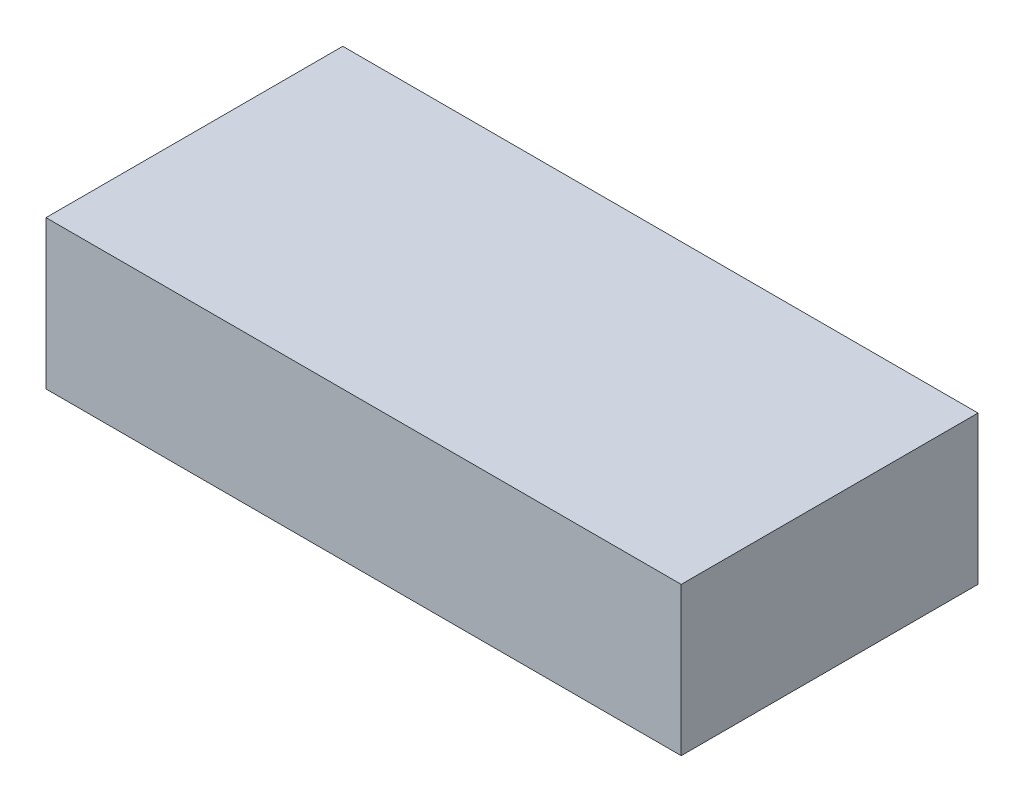
ISO-10303-21;
HEADER;
FILE_DESCRIPTION(('STEP AP214'),'2;1');
FILE_NAME('part.step','',(''),(''),'','','');
FILE_SCHEMA(('AUTOMOTIVE_DESIGN { 1 0 10303 214 1 1 1 1 }'));
ENDSEC;
DATA;
#1=APPLICATION_CONTEXT('core data for automotive mechanical design processes');
#2=APPLICATION_PROTOCOL_DEFINITION('international standard','automotive_design',2000,#1);
#3=PRODUCT_CONTEXT('',#1,'mechanical');
#4=PRODUCT('Part','Part','',(#3));
#5=PRODUCT_RELATED_PRODUCT_CATEGORY('part','',(#4));
#6=PRODUCT_DEFINITION_FORMATION('','',#4);
#7=PRODUCT_DEFINITION_CONTEXT('part definition',#1,'design');
#8=PRODUCT_DEFINITION('design','',#6,#7);
#9=PRODUCT_DEFINITION_SHAPE('','',#8);
#10=(LENGTH_UNIT() NAMED_UNIT(*) SI_UNIT(.MILLI.,.METRE.));
#11=(NAMED_UNIT(*) PLANE_ANGLE_UNIT() SI_UNIT($,.RADIAN.));
#12=(NAMED_UNIT(*) SI_UNIT($,.STERADIAN.) SOLID_ANGLE_UNIT());
#13=UNCERTAINTY_MEASURE_WITH_UNIT(LENGTH_MEASURE(1.E-05),#10,'distance_accuracy_value','');
#14=(GEOMETRIC_REPRESENTATION_CONTEXT(3) GLOBAL_UNCERTAINTY_ASSIGNED_CONTEXT((#13)) GLOBAL_UNIT_ASSIGNED_CONTEXT((#10,
#11,#12)) REPRESENTATION_CONTEXT('',''));
#15=CARTESIAN_POINT('',(0.,0.,0.));
#16=DIRECTION('',(0.,0.,1.));
#17=DIRECTION('',(1.,0.,0.));
#18=AXIS2_PLACEMENT_3D('',#15,#16,#17);
#19=CARTESIAN_POINT('',(244.,114.,-114.));
#20=DIRECTION('',(-1.,0.,0.));
#21=DIRECTION('',(0.,0.,1.));
#22=AXIS2_PLACEMENT_3D('',#19,#20,#21);
#23=PLANE('',#22);
#24=DIRECTION('',(0.,0.,-1.));
#25=VECTOR('',#24,1.);
#26=CARTESIAN_POINT('',(244.,0.,-114.));
#27=LINE('',#26,#25);
#28=CARTESIAN_POINT('',(244.,0.,114.));
#29=VERTEX_POINT('',#28);
#30=CARTESIAN_POINT('',(244.,0.,-114.));
#31=VERTEX_POINT('',#30);
#32=EDGE_CURVE('E107',#29,#31,#27,.T.);
#33=ORIENTED_EDGE('',*,*,#32,.T.);
#34=DIRECTION('',(0.,-1.,0.));
#35=VECTOR('',#34,1.);
#36=CARTESIAN_POINT('',(244.,114.,-114.));
#37=LINE('',#36,#35);
#38=CARTESIAN_POINT('',(244.,114.,-114.));
#39=VERTEX_POINT('',#38);
#40=EDGE_CURVE('E11',#39,#31,#37,.T.);
#41=ORIENTED_EDGE('',*,*,#40,.F.);
#42=DIRECTION('',(0.,0.,-1.));
#43=VECTOR('',#42,1.);
#44=CARTESIAN_POINT('',(244.,114.,-114.));
#45=LINE('',#44,#43);
#46=CARTESIAN_POINT('',(244.,114.,114.));
#47=VERTEX_POINT('',#46);
#48=EDGE_CURVE('E91',#47,#39,#45,.T.);
#49=ORIENTED_EDGE('',*,*,#48,.F.);
#50=DIRECTION('',(0.,-1.,0.));
#51=VECTOR('',#50,1.);
#52=CARTESIAN_POINT('',(244.,114.,114.));
#53=LINE('',#52,#51);
#54=EDGE_CURVE('E103',#47,#29,#53,.T.);
#55=ORIENTED_EDGE('',*,*,#54,.T.);
#56=EDGE_LOOP('',(#33,#41,#49,#55));
#57=FACE_BOUND('',#56,.T.);
#58=ADVANCED_FACE('F39',(#57),#23,.F.);
#59=CARTESIAN_POINT('',(-244.,114.,-114.));
#60=DIRECTION('',(0.,0.,1.));
#61=DIRECTION('',(1.,0.,0.));
#62=AXIS2_PLACEMENT_3D('',#59,#60,#61);
#63=PLANE('',#62);
#64=DIRECTION('',(-1.,0.,0.));
#65=VECTOR('',#64,1.);
#66=CARTESIAN_POINT('',(-244.,0.,-114.));
#67=LINE('',#66,#65);
#68=CARTESIAN_POINT('',(-244.,0.,-114.));
#69=VERTEX_POINT('',#68);
#70=EDGE_CURVE('E96',#31,#69,#67,.T.);
#71=ORIENTED_EDGE('',*,*,#70,.T.);
#72=DIRECTION('',(0.,-1.,0.));
#73=VECTOR('',#72,1.);
#74=CARTESIAN_POINT('',(-244.,114.,-114.));
#75=LINE('',#74,#73);
#76=CARTESIAN_POINT('',(-244.,114.,-114.));
#77=VERTEX_POINT('',#76);
#78=EDGE_CURVE('E48',#77,#69,#75,.T.);
#79=ORIENTED_EDGE('',*,*,#78,.F.);
#80=DIRECTION('',(-1.,0.,0.));
#81=VECTOR('',#80,1.);
#82=CARTESIAN_POINT('',(-244.,114.,-114.));
#83=LINE('',#82,#81);
#84=EDGE_CURVE('E86',#39,#77,#83,.T.);
#85=ORIENTED_EDGE('',*,*,#84,.F.);
#86=ORIENTED_EDGE('',*,*,#40,.T.);
#87=EDGE_LOOP('',(#71,#79,#85,#86));
#88=FACE_BOUND('',#87,.T.);
#89=ADVANCED_FACE('F95',(#88),#63,.F.);
#90=CARTESIAN_POINT('',(-244.,114.,-114.));
#91=DIRECTION('',(1.,0.,0.));
#92=DIRECTION('',(0.,0.,-1.));
#93=AXIS2_PLACEMENT_3D('',#90,#91,#92);
#94=PLANE('',#93);
#95=DIRECTION('',(0.,0.,1.));
#96=VECTOR('',#95,1.);
#97=CARTESIAN_POINT('',(-244.,0.,-114.));
#98=LINE('',#97,#96);
#99=CARTESIAN_POINT('',(-244.,0.,114.));
#100=VERTEX_POINT('',#99);
#101=EDGE_CURVE('E73',#69,#100,#98,.T.);
#102=ORIENTED_EDGE('',*,*,#101,.T.);
#103=DIRECTION('',(0.,-1.,0.));
#104=VECTOR('',#103,1.);
#105=CARTESIAN_POINT('',(-244.,114.,114.));
#106=LINE('',#105,#104);
#107=CARTESIAN_POINT('',(-244.,114.,114.));
#108=VERTEX_POINT('',#107);
#109=EDGE_CURVE('E98',#108,#100,#106,.T.);
#110=ORIENTED_EDGE('',*,*,#109,.F.);
#111=DIRECTION('',(0.,0.,1.));
#112=VECTOR('',#111,1.);
#113=CARTESIAN_POINT('',(-244.,114.,-114.));
#114=LINE('',#113,#112);
#115=EDGE_CURVE('E89',#77,#108,#114,.T.);
#116=ORIENTED_EDGE('',*,*,#115,.F.);
#117=ORIENTED_EDGE('',*,*,#78,.T.);
#118=EDGE_LOOP('',(#102,#110,#116,#117));
#119=FACE_BOUND('',#118,.T.);
#120=ADVANCED_FACE('F99',(#119),#94,.F.);
#121=CARTESIAN_POINT('',(-244.,114.,114.));
#122=DIRECTION('',(0.,0.,-1.));
#123=DIRECTION('',(-1.,0.,0.));
#124=AXIS2_PLACEMENT_3D('',#121,#122,#123);
#125=PLANE('',#124);
#126=DIRECTION('',(1.,0.,0.));
#127=VECTOR('',#126,1.);
#128=CARTESIAN_POINT('',(-244.,0.,114.));
#129=LINE('',#128,#127);
#130=EDGE_CURVE('E79',#100,#29,#129,.T.);
#131=ORIENTED_EDGE('',*,*,#130,.T.);
#132=ORIENTED_EDGE('',*,*,#54,.F.);
#133=DIRECTION('',(1.,0.,0.));
#134=VECTOR('',#133,1.);
#135=CARTESIAN_POINT('',(-244.,114.,114.));
#136=LINE('',#135,#134);
#137=EDGE_CURVE('E56',#108,#47,#136,.T.);
#138=ORIENTED_EDGE('',*,*,#137,.F.);
#139=ORIENTED_EDGE('',*,*,#109,.T.);
#140=EDGE_LOOP('',(#131,#132,#138,#139));
#141=FACE_BOUND('',#140,.T.);
#142=ADVANCED_FACE('F120',(#141),#125,.F.);
#143=CARTESIAN_POINT('',(0.,114.,0.));
#144=DIRECTION('',(0.,1.,0.));
#145=DIRECTION('',(0.,0.,1.));
#146=AXIS2_PLACEMENT_3D('',#143,#144,#145);
#147=PLANE('',#146);
#148=ORIENTED_EDGE('',*,*,#48,.T.);
#149=ORIENTED_EDGE('',*,*,#84,.T.);
#150=ORIENTED_EDGE('',*,*,#115,.T.);
#151=ORIENTED_EDGE('',*,*,#137,.T.);
#152=EDGE_LOOP('',(#148,#149,#150,#151));
#153=FACE_BOUND('',#152,.T.);
#154=ADVANCED_FACE('F87',(#153),#147,.T.);
#155=CARTESIAN_POINT('',(0.,0.,0.));
#156=DIRECTION('',(0.,1.,0.));
#157=DIRECTION('',(0.,0.,1.));
#158=AXIS2_PLACEMENT_3D('',#155,#156,#157);
#159=PLANE('',#158);
#160=ORIENTED_EDGE('',*,*,#32,.F.);
#161=ORIENTED_EDGE('',*,*,#130,.F.);
#162=ORIENTED_EDGE('',*,*,#101,.F.);
#163=ORIENTED_EDGE('',*,*,#70,.F.);
#164=EDGE_LOOP('',(#160,#161,#162,#163));
#165=FACE_BOUND('',#164,.T.);
#166=ADVANCED_FACE('F123',(#165),#159,.F.);
#167=CLOSED_SHELL('',(#58,#89,#120,#142,#154,#166));
#168=MANIFOLD_SOLID_BREP('B2',#167);
#169=ADVANCED_BREP_SHAPE_REPRESENTATION('',(#18,#168),#14);
#170=SHAPE_DEFINITION_REPRESENTATION(#9,#169);
ENDSEC;
END-ISO-10303-21;
